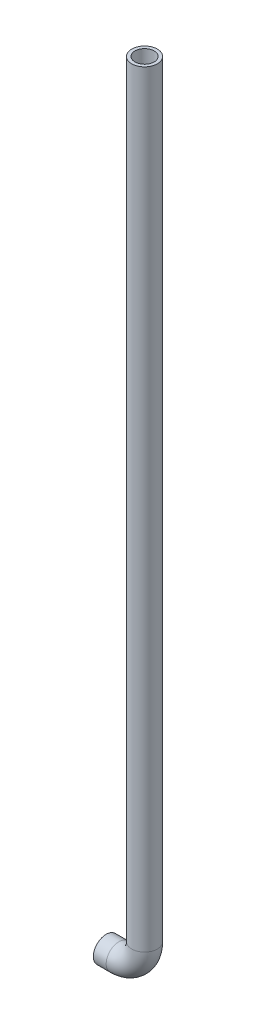
ISO-10303-21;
HEADER;
FILE_DESCRIPTION(('STEP AP214'),'2;1');
FILE_NAME('part.step','',(''),(''),'','','');
FILE_SCHEMA(('AUTOMOTIVE_DESIGN { 1 0 10303 214 1 1 1 1 }'));
ENDSEC;
DATA;
#1=APPLICATION_CONTEXT('core data for automotive mechanical design processes');
#2=APPLICATION_PROTOCOL_DEFINITION('international standard','automotive_design',2000,#1);
#3=PRODUCT_CONTEXT('',#1,'mechanical');
#4=PRODUCT('Part','Part','',(#3));
#5=PRODUCT_RELATED_PRODUCT_CATEGORY('part','',(#4));
#6=PRODUCT_DEFINITION_FORMATION('','',#4);
#7=PRODUCT_DEFINITION_CONTEXT('part definition',#1,'design');
#8=PRODUCT_DEFINITION('design','',#6,#7);
#9=PRODUCT_DEFINITION_SHAPE('','',#8);
#10=(LENGTH_UNIT() NAMED_UNIT(*) SI_UNIT(.MILLI.,.METRE.));
#11=(NAMED_UNIT(*) PLANE_ANGLE_UNIT() SI_UNIT($,.RADIAN.));
#12=(NAMED_UNIT(*) SI_UNIT($,.STERADIAN.) SOLID_ANGLE_UNIT());
#13=UNCERTAINTY_MEASURE_WITH_UNIT(LENGTH_MEASURE(1.E-05),#10,'distance_accuracy_value','');
#14=(GEOMETRIC_REPRESENTATION_CONTEXT(3) GLOBAL_UNCERTAINTY_ASSIGNED_CONTEXT((#13)) GLOBAL_UNIT_ASSIGNED_CONTEXT((#10,
#11,#12)) REPRESENTATION_CONTEXT('',''));
#15=CARTESIAN_POINT('',(0.,0.,0.));
#16=DIRECTION('',(0.,0.,1.));
#17=DIRECTION('',(1.,0.,0.));
#18=AXIS2_PLACEMENT_3D('',#15,#16,#17);
#19=CARTESIAN_POINT('',(38.0999999999999,786.13,0.));
#20=DIRECTION('',(0.,1.,0.));
#21=DIRECTION('',(-1.,0.,0.));
#22=AXIS2_PLACEMENT_3D('',#19,#20,#21);
#23=PLANE('',#22);
#24=CARTESIAN_POINT('',(38.0999999999999,786.13,0.));
#25=DIRECTION('',(0.,1.,0.));
#26=DIRECTION('',(-1.,0.,0.));
#27=AXIS2_PLACEMENT_3D('',#24,#25,#26);
#28=CIRCLE('',#27,9.525);
#29=CARTESIAN_POINT('',(47.6249999999999,786.13,0.));
#30=VERTEX_POINT('',#29);
#31=EDGE_CURVE('E106',#30,#30,#28,.T.);
#32=ORIENTED_EDGE('',*,*,#31,.F.);
#33=EDGE_LOOP('',(#32));
#34=FACE_BOUND('',#33,.T.);
#35=CARTESIAN_POINT('',(38.0999999999999,786.13,0.));
#36=DIRECTION('',(0.,1.,0.));
#37=DIRECTION('',(-1.,0.,0.));
#38=AXIS2_PLACEMENT_3D('',#35,#36,#37);
#39=CIRCLE('',#38,12.7);
#40=CARTESIAN_POINT('',(25.3999999999999,786.13,0.));
#41=VERTEX_POINT('',#40);
#42=EDGE_CURVE('E59',#41,#41,#39,.T.);
#43=ORIENTED_EDGE('',*,*,#42,.T.);
#44=EDGE_LOOP('',(#43));
#45=FACE_BOUND('',#44,.T.);
#46=ADVANCED_FACE('F47',(#34,#45),#23,.T.);
#47=CARTESIAN_POINT('',(0.,0.,0.));
#48=DIRECTION('',(1.,0.,0.));
#49=DIRECTION('',(0.,1.,0.));
#50=AXIS2_PLACEMENT_3D('',#47,#48,#49);
#51=PLANE('',#50);
#52=CARTESIAN_POINT('',(0.,0.,0.));
#53=DIRECTION('',(1.,0.,0.));
#54=DIRECTION('',(0.,1.,0.));
#55=AXIS2_PLACEMENT_3D('',#52,#53,#54);
#56=CIRCLE('',#55,9.525);
#57=CARTESIAN_POINT('',(0.,-9.525,0.));
#58=VERTEX_POINT('',#57);
#59=EDGE_CURVE('E108',#58,#58,#56,.T.);
#60=ORIENTED_EDGE('',*,*,#59,.T.);
#61=EDGE_LOOP('',(#60));
#62=FACE_BOUND('',#61,.T.);
#63=CARTESIAN_POINT('',(0.,0.,0.));
#64=DIRECTION('',(1.,0.,0.));
#65=DIRECTION('',(0.,1.,0.));
#66=AXIS2_PLACEMENT_3D('',#63,#64,#65);
#67=CIRCLE('',#66,12.7);
#68=CARTESIAN_POINT('',(0.,12.7,0.));
#69=VERTEX_POINT('',#68);
#70=EDGE_CURVE('E12',#69,#69,#67,.T.);
#71=ORIENTED_EDGE('',*,*,#70,.F.);
#72=EDGE_LOOP('',(#71));
#73=FACE_BOUND('',#72,.T.);
#74=ADVANCED_FACE('F65',(#62,#73),#51,.F.);
#75=CARTESIAN_POINT('',(38.0999999999999,786.13,0.));
#76=DIRECTION('',(0.,-1.,0.));
#77=DIRECTION('',(1.,0.,0.));
#78=AXIS2_PLACEMENT_3D('',#75,#76,#77);
#79=CYLINDRICAL_SURFACE('',#78,12.7);
#80=CARTESIAN_POINT('',(38.1,25.4000000000002,0.));
#81=DIRECTION('',(0.,1.,0.));
#82=DIRECTION('',(-1.,0.,0.));
#83=AXIS2_PLACEMENT_3D('',#80,#81,#82);
#84=CIRCLE('',#83,12.7);
#85=CARTESIAN_POINT('',(50.8,25.4000000000003,0.));
#86=VERTEX_POINT('',#85);
#87=EDGE_CURVE('E115',#86,#86,#84,.T.);
#88=ORIENTED_EDGE('',*,*,#87,.T.);
#89=EDGE_LOOP('',(#88));
#90=FACE_BOUND('',#89,.T.);
#91=ORIENTED_EDGE('',*,*,#42,.F.);
#92=EDGE_LOOP('',(#91));
#93=FACE_BOUND('',#92,.T.);
#94=ADVANCED_FACE('F67',(#90,#93),#79,.T.);
#95=CARTESIAN_POINT('',(12.7,25.4,0.));
#96=DIRECTION('',(0.,0.,-1.));
#97=DIRECTION('',(-1.,0.,0.));
#98=AXIS2_PLACEMENT_3D('',#95,#96,#97);
#99=TOROIDAL_SURFACE('',#98,25.4,12.7);
#100=CARTESIAN_POINT('',(12.7,0.,0.));
#101=DIRECTION('',(1.,0.,0.));
#102=DIRECTION('',(0.,1.,0.));
#103=AXIS2_PLACEMENT_3D('',#100,#101,#102);
#104=CIRCLE('',#103,12.7);
#105=CARTESIAN_POINT('',(12.7,-12.7,0.));
#106=VERTEX_POINT('',#105);
#107=EDGE_CURVE('E54',#106,#106,#104,.T.);
#108=CARTESIAN_POINT('',(12.7,25.4,0.));
#109=DIRECTION('',(0.,0.,-1.));
#110=DIRECTION('',(-1.,0.,0.));
#111=AXIS2_PLACEMENT_3D('',#108,#109,#110);
#112=CIRCLE('',#111,38.1);
#113=EDGE_CURVE('',#86,#106,#112,.T.);
#114=ORIENTED_EDGE('',*,*,#87,.F.);
#115=ORIENTED_EDGE('',*,*,#107,.T.);
#116=ORIENTED_EDGE('',*,*,#113,.T.);
#117=ORIENTED_EDGE('',*,*,#113,.F.);
#118=EDGE_LOOP('',(#114,#116,#115,#117));
#119=FACE_BOUND('',#118,.T.);
#120=ADVANCED_FACE('F73',(#119),#99,.T.);
#121=CARTESIAN_POINT('',(12.7,0.,0.));
#122=DIRECTION('',(-1.,0.,0.));
#123=DIRECTION('',(0.,-1.,0.));
#124=AXIS2_PLACEMENT_3D('',#121,#122,#123);
#125=CYLINDRICAL_SURFACE('',#124,12.7);
#126=ORIENTED_EDGE('',*,*,#70,.T.);
#127=EDGE_LOOP('',(#126));
#128=FACE_BOUND('',#127,.T.);
#129=ORIENTED_EDGE('',*,*,#107,.F.);
#130=EDGE_LOOP('',(#129));
#131=FACE_BOUND('',#130,.T.);
#132=ADVANCED_FACE('F62',(#128,#131),#125,.T.);
#133=CARTESIAN_POINT('',(38.0999999999999,786.13,0.));
#134=DIRECTION('',(0.,-1.,0.));
#135=DIRECTION('',(1.,0.,0.));
#136=AXIS2_PLACEMENT_3D('',#133,#134,#135);
#137=CYLINDRICAL_SURFACE('',#136,9.525);
#138=CARTESIAN_POINT('',(38.1,25.4000000000004,0.));
#139=DIRECTION('',(0.,-1.,0.));
#140=DIRECTION('',(1.,0.,0.));
#141=AXIS2_PLACEMENT_3D('',#138,#139,#140);
#142=CIRCLE('',#141,9.525);
#143=CARTESIAN_POINT('',(47.625,25.4000000000004,0.));
#144=VERTEX_POINT('',#143);
#145=EDGE_CURVE('E105',#144,#144,#142,.F.);
#146=CARTESIAN_POINT('',(47.625,25.4000000000004,0.));
#147=CARTESIAN_POINT('',(47.625,33.3242708333337,0.));
#148=CARTESIAN_POINT('',(47.625,41.2485416666671,0.));
#149=CARTESIAN_POINT('',(47.625,57.0970833333337,0.));
#150=CARTESIAN_POINT('',(47.625,65.021354166667,0.));
#151=CARTESIAN_POINT('',(47.625,80.8698958333337,0.));
#152=CARTESIAN_POINT('',(47.625,88.7941666666671,0.));
#153=CARTESIAN_POINT('',(47.625,104.642708333334,0.));
#154=CARTESIAN_POINT('',(47.625,112.566979166667,0.));
#155=CARTESIAN_POINT('',(47.625,128.415520833334,0.));
#156=CARTESIAN_POINT('',(47.625,136.339791666667,0.));
#157=CARTESIAN_POINT('',(47.625,152.188333333334,0.));
#158=CARTESIAN_POINT('',(47.625,160.112604166667,0.));
#159=CARTESIAN_POINT('',(47.625,175.961145833334,0.));
#160=CARTESIAN_POINT('',(47.625,183.885416666667,0.));
#161=CARTESIAN_POINT('',(47.625,199.733958333334,0.));
#162=CARTESIAN_POINT('',(47.625,207.658229166667,0.));
#163=CARTESIAN_POINT('',(47.625,223.506770833334,0.));
#164=CARTESIAN_POINT('',(47.625,231.431041666667,0.));
#165=CARTESIAN_POINT('',(47.625,247.279583333334,0.));
#166=CARTESIAN_POINT('',(47.625,255.203854166667,0.));
#167=CARTESIAN_POINT('',(47.625,271.052395833334,0.));
#168=CARTESIAN_POINT('',(47.625,278.976666666667,0.));
#169=CARTESIAN_POINT('',(47.625,294.825208333334,0.));
#170=CARTESIAN_POINT('',(47.625,302.749479166667,0.));
#171=CARTESIAN_POINT('',(47.625,318.598020833334,0.));
#172=CARTESIAN_POINT('',(47.625,326.522291666667,0.));
#173=CARTESIAN_POINT('',(47.625,342.370833333334,0.));
#174=CARTESIAN_POINT('',(47.625,350.295104166667,0.));
#175=CARTESIAN_POINT('',(47.625,366.143645833334,0.));
#176=CARTESIAN_POINT('',(47.6249999999999,374.067916666667,0.));
#177=CARTESIAN_POINT('',(47.6249999999999,389.916458333334,0.));
#178=CARTESIAN_POINT('',(47.6249999999999,397.840729166667,0.));
#179=CARTESIAN_POINT('',(47.6249999999999,413.689270833334,0.));
#180=CARTESIAN_POINT('',(47.6249999999999,421.613541666667,0.));
#181=CARTESIAN_POINT('',(47.6249999999999,437.462083333334,0.));
#182=CARTESIAN_POINT('',(47.6249999999999,445.386354166667,0.));
#183=CARTESIAN_POINT('',(47.6249999999999,461.234895833334,0.));
#184=CARTESIAN_POINT('',(47.6249999999999,469.159166666667,0.));
#185=CARTESIAN_POINT('',(47.6249999999999,485.007708333334,0.));
#186=CARTESIAN_POINT('',(47.6249999999999,492.931979166667,0.));
#187=CARTESIAN_POINT('',(47.6249999999999,508.780520833333,0.));
#188=CARTESIAN_POINT('',(47.6249999999999,516.704791666667,0.));
#189=CARTESIAN_POINT('',(47.6249999999999,532.553333333333,0.));
#190=CARTESIAN_POINT('',(47.6249999999999,540.477604166667,0.));
#191=CARTESIAN_POINT('',(47.6249999999999,556.326145833333,0.));
#192=CARTESIAN_POINT('',(47.6249999999999,564.250416666667,0.));
#193=CARTESIAN_POINT('',(47.6249999999999,580.098958333333,0.));
#194=CARTESIAN_POINT('',(47.6249999999999,588.023229166667,0.));
#195=CARTESIAN_POINT('',(47.6249999999999,603.871770833333,0.));
#196=CARTESIAN_POINT('',(47.6249999999999,611.796041666667,0.));
#197=CARTESIAN_POINT('',(47.6249999999999,627.644583333333,0.));
#198=CARTESIAN_POINT('',(47.6249999999999,635.568854166667,0.));
#199=CARTESIAN_POINT('',(47.6249999999999,651.417395833333,0.));
#200=CARTESIAN_POINT('',(47.6249999999999,659.341666666667,0.));
#201=CARTESIAN_POINT('',(47.6249999999999,675.190208333333,0.));
#202=CARTESIAN_POINT('',(47.6249999999999,683.114479166667,0.));
#203=CARTESIAN_POINT('',(47.6249999999999,698.963020833333,0.));
#204=CARTESIAN_POINT('',(47.6249999999999,706.887291666667,0.));
#205=CARTESIAN_POINT('',(47.6249999999999,722.735833333333,0.));
#206=CARTESIAN_POINT('',(47.6249999999999,730.660104166667,0.));
#207=CARTESIAN_POINT('',(47.6249999999999,746.508645833333,0.));
#208=CARTESIAN_POINT('',(47.6249999999999,754.432916666667,0.));
#209=CARTESIAN_POINT('',(47.6249999999999,770.281458333333,0.));
#210=CARTESIAN_POINT('',(47.6249999999999,778.205729166667,0.));
#211=CARTESIAN_POINT('',(47.6249999999999,786.13,0.));
#212=B_SPLINE_CURVE_WITH_KNOTS('',3,(#146,#147,#148,#149,#150,#151,#152,#153,#154,#155,#156,
#157,#158,#159,#160,#161,#162,#163,#164,#165,#166,#167,#168,#169,#170,#171,#172,#173,#174,#175,
#176,#177,#178,#179,#180,#181,#182,#183,#184,#185,#186,#187,#188,#189,#190,#191,#192,#193,#194,
#195,#196,#197,#198,#199,#200,#201,#202,#203,#204,#205,#206,#207,#208,#209,#210,#211),
.UNSPECIFIED.,.F.,.F.,(4,2,2,2,2,2,2,2,2,2,2,2,2,2,2,2,2,2,2,2,2,2,2,2,2,2,2,2,2,2,2,2,4),(0.,
23.7728125,47.5456249999999,71.3184375,95.09125,118.8640625,142.636875,166.4096875,190.1825,
213.9553125,237.728125,261.5009375,285.27375,309.0465625,332.819375,356.5921875,380.365,
404.1378125,427.910625,451.6834375,475.45625,499.2290625,523.001875,546.7746875,570.5475,
594.3203125,618.093125,641.8659375,665.63875,689.4115625,713.184375,736.9571875,760.73),.UNSPECIFIED.);
#213=EDGE_CURVE('BSEAM81',#144,#30,#212,.T.);
#214=ORIENTED_EDGE('',*,*,#145,.F.);
#215=ORIENTED_EDGE('',*,*,#31,.T.);
#216=ORIENTED_EDGE('',*,*,#213,.T.);
#217=ORIENTED_EDGE('',*,*,#213,.F.);
#218=EDGE_LOOP('',(#214,#216,#215,#217));
#219=FACE_BOUND('',#218,.T.);
#220=ADVANCED_FACE('F81',(#219),#137,.F.);
#221=CARTESIAN_POINT('',(12.7,25.4,0.));
#222=DIRECTION('',(0.,0.,-1.));
#223=DIRECTION('',(-1.,0.,0.));
#224=AXIS2_PLACEMENT_3D('',#221,#222,#223);
#225=TOROIDAL_SURFACE('',#224,25.4,9.525);
#226=CARTESIAN_POINT('',(12.7,0.,0.));
#227=DIRECTION('',(1.,0.,0.));
#228=DIRECTION('',(0.,1.,0.));
#229=AXIS2_PLACEMENT_3D('',#226,#227,#228);
#230=CIRCLE('',#229,9.525);
#231=CARTESIAN_POINT('',(12.7,-9.525,0.));
#232=VERTEX_POINT('',#231);
#233=EDGE_CURVE('E102',#232,#232,#230,.T.);
#234=CARTESIAN_POINT('',(12.7,25.4,0.));
#235=DIRECTION('',(0.,0.,-1.));
#236=DIRECTION('',(-1.,0.,0.));
#237=AXIS2_PLACEMENT_3D('',#234,#235,#236);
#238=CIRCLE('',#237,34.925);
#239=EDGE_CURVE('',#144,#232,#238,.T.);
#240=ORIENTED_EDGE('',*,*,#145,.T.);
#241=ORIENTED_EDGE('',*,*,#233,.F.);
#242=ORIENTED_EDGE('',*,*,#239,.T.);
#243=ORIENTED_EDGE('',*,*,#239,.F.);
#244=EDGE_LOOP('',(#240,#242,#241,#243));
#245=FACE_BOUND('',#244,.T.);
#246=ADVANCED_FACE('F86',(#245),#225,.F.);
#247=CARTESIAN_POINT('',(12.7,0.,0.));
#248=DIRECTION('',(-1.,0.,0.));
#249=DIRECTION('',(0.,-1.,0.));
#250=AXIS2_PLACEMENT_3D('',#247,#248,#249);
#251=CYLINDRICAL_SURFACE('',#250,9.525);
#252=CARTESIAN_POINT('',(0.,-9.525,0.));
#253=CARTESIAN_POINT('',(0.132291666666667,-9.525,0.));
#254=CARTESIAN_POINT('',(0.264583333333333,-9.525,0.));
#255=CARTESIAN_POINT('',(0.529166666666667,-9.525,0.));
#256=CARTESIAN_POINT('',(0.661458333333334,-9.525,0.));
#257=CARTESIAN_POINT('',(0.926041666666668,-9.525,0.));
#258=CARTESIAN_POINT('',(1.05833333333333,-9.525,0.));
#259=CARTESIAN_POINT('',(1.32291666666667,-9.525,0.));
#260=CARTESIAN_POINT('',(1.45520833333333,-9.525,0.));
#261=CARTESIAN_POINT('',(1.71979166666667,-9.525,0.));
#262=CARTESIAN_POINT('',(1.85208333333333,-9.525,0.));
#263=CARTESIAN_POINT('',(2.11666666666667,-9.525,0.));
#264=CARTESIAN_POINT('',(2.24895833333333,-9.525,0.));
#265=CARTESIAN_POINT('',(2.51354166666667,-9.525,0.));
#266=CARTESIAN_POINT('',(2.64583333333333,-9.525,0.));
#267=CARTESIAN_POINT('',(2.91041666666667,-9.525,0.));
#268=CARTESIAN_POINT('',(3.04270833333333,-9.525,0.));
#269=CARTESIAN_POINT('',(3.30729166666667,-9.525,0.));
#270=CARTESIAN_POINT('',(3.43958333333333,-9.525,0.));
#271=CARTESIAN_POINT('',(3.70416666666667,-9.525,0.));
#272=CARTESIAN_POINT('',(3.83645833333334,-9.525,0.));
#273=CARTESIAN_POINT('',(4.10104166666667,-9.525,0.));
#274=CARTESIAN_POINT('',(4.23333333333333,-9.525,0.));
#275=CARTESIAN_POINT('',(4.49791666666667,-9.525,0.));
#276=CARTESIAN_POINT('',(4.63020833333334,-9.525,0.));
#277=CARTESIAN_POINT('',(4.89479166666667,-9.525,0.));
#278=CARTESIAN_POINT('',(5.02708333333334,-9.525,0.));
#279=CARTESIAN_POINT('',(5.29166666666667,-9.525,0.));
#280=CARTESIAN_POINT('',(5.42395833333333,-9.525,0.));
#281=CARTESIAN_POINT('',(5.68854166666667,-9.525,0.));
#282=CARTESIAN_POINT('',(5.82083333333333,-9.525,0.));
#283=CARTESIAN_POINT('',(6.08541666666667,-9.525,0.));
#284=CARTESIAN_POINT('',(6.21770833333334,-9.525,0.));
#285=CARTESIAN_POINT('',(6.48229166666667,-9.525,0.));
#286=CARTESIAN_POINT('',(6.61458333333334,-9.525,0.));
#287=CARTESIAN_POINT('',(6.87916666666667,-9.525,0.));
#288=CARTESIAN_POINT('',(7.01145833333334,-9.525,0.));
#289=CARTESIAN_POINT('',(7.27604166666667,-9.525,0.));
#290=CARTESIAN_POINT('',(7.40833333333334,-9.525,0.));
#291=CARTESIAN_POINT('',(7.67291666666667,-9.525,0.));
#292=CARTESIAN_POINT('',(7.80520833333334,-9.525,0.));
#293=CARTESIAN_POINT('',(8.06979166666667,-9.525,0.));
#294=CARTESIAN_POINT('',(8.20208333333334,-9.525,0.));
#295=CARTESIAN_POINT('',(8.46666666666667,-9.525,0.));
#296=CARTESIAN_POINT('',(8.59895833333334,-9.525,0.));
#297=CARTESIAN_POINT('',(8.86354166666667,-9.525,0.));
#298=CARTESIAN_POINT('',(8.99583333333334,-9.525,0.));
#299=CARTESIAN_POINT('',(9.26041666666667,-9.525,0.));
#300=CARTESIAN_POINT('',(9.39270833333334,-9.525,0.));
#301=CARTESIAN_POINT('',(9.65729166666667,-9.525,0.));
#302=CARTESIAN_POINT('',(9.78958333333334,-9.525,0.));
#303=CARTESIAN_POINT('',(10.0541666666667,-9.525,0.));
#304=CARTESIAN_POINT('',(10.1864583333333,-9.525,0.));
#305=CARTESIAN_POINT('',(10.4510416666667,-9.525,0.));
#306=CARTESIAN_POINT('',(10.5833333333333,-9.525,0.));
#307=CARTESIAN_POINT('',(10.8479166666667,-9.525,0.));
#308=CARTESIAN_POINT('',(10.9802083333333,-9.525,0.));
#309=CARTESIAN_POINT('',(11.2447916666667,-9.525,0.));
#310=CARTESIAN_POINT('',(11.3770833333333,-9.525,0.));
#311=CARTESIAN_POINT('',(11.6416666666667,-9.525,0.));
#312=CARTESIAN_POINT('',(11.7739583333333,-9.525,0.));
#313=CARTESIAN_POINT('',(12.0385416666667,-9.525,0.));
#314=CARTESIAN_POINT('',(12.1708333333333,-9.525,0.));
#315=CARTESIAN_POINT('',(12.4354166666667,-9.525,0.));
#316=CARTESIAN_POINT('',(12.5677083333333,-9.525,0.));
#317=CARTESIAN_POINT('',(12.7,-9.525,0.));
#318=B_SPLINE_CURVE_WITH_KNOTS('',3,(#252,#253,#254,#255,#256,#257,#258,#259,#260,#261,#262,
#263,#264,#265,#266,#267,#268,#269,#270,#271,#272,#273,#274,#275,#276,#277,#278,#279,#280,#281,
#282,#283,#284,#285,#286,#287,#288,#289,#290,#291,#292,#293,#294,#295,#296,#297,#298,#299,#300,
#301,#302,#303,#304,#305,#306,#307,#308,#309,#310,#311,#312,#313,#314,#315,#316,#317),
.UNSPECIFIED.,.F.,.F.,(4,2,2,2,2,2,2,2,2,2,2,2,2,2,2,2,2,2,2,2,2,2,2,2,2,2,2,2,2,2,2,2,4),(0.,
0.396875,0.793750000000001,1.190625,1.5875,1.984375,2.38125,2.778125,3.175,3.571875,3.96875,
4.365625,4.7625,5.159375,5.55625,5.953125,6.35,6.746875,7.14375,7.540625,7.9375,8.334375,
8.73125,9.128125,9.525,9.921875,10.31875,10.715625,11.1125,11.509375,11.90625,12.303125,12.7),.UNSPECIFIED.);
#319=EDGE_CURVE('BSEAM77',#58,#232,#318,.T.);
#320=ORIENTED_EDGE('',*,*,#59,.F.);
#321=ORIENTED_EDGE('',*,*,#233,.T.);
#322=ORIENTED_EDGE('',*,*,#319,.T.);
#323=ORIENTED_EDGE('',*,*,#319,.F.);
#324=EDGE_LOOP('',(#320,#322,#321,#323));
#325=FACE_BOUND('',#324,.T.);
#326=ADVANCED_FACE('F77',(#325),#251,.F.);
#327=CLOSED_SHELL('',(#46,#74,#94,#120,#132,#220,#246,#326));
#328=MANIFOLD_SOLID_BREP('B2',#327);
#329=ADVANCED_BREP_SHAPE_REPRESENTATION('',(#18,#328),#14);
#330=SHAPE_DEFINITION_REPRESENTATION(#9,#329);
ENDSEC;
END-ISO-10303-21;
